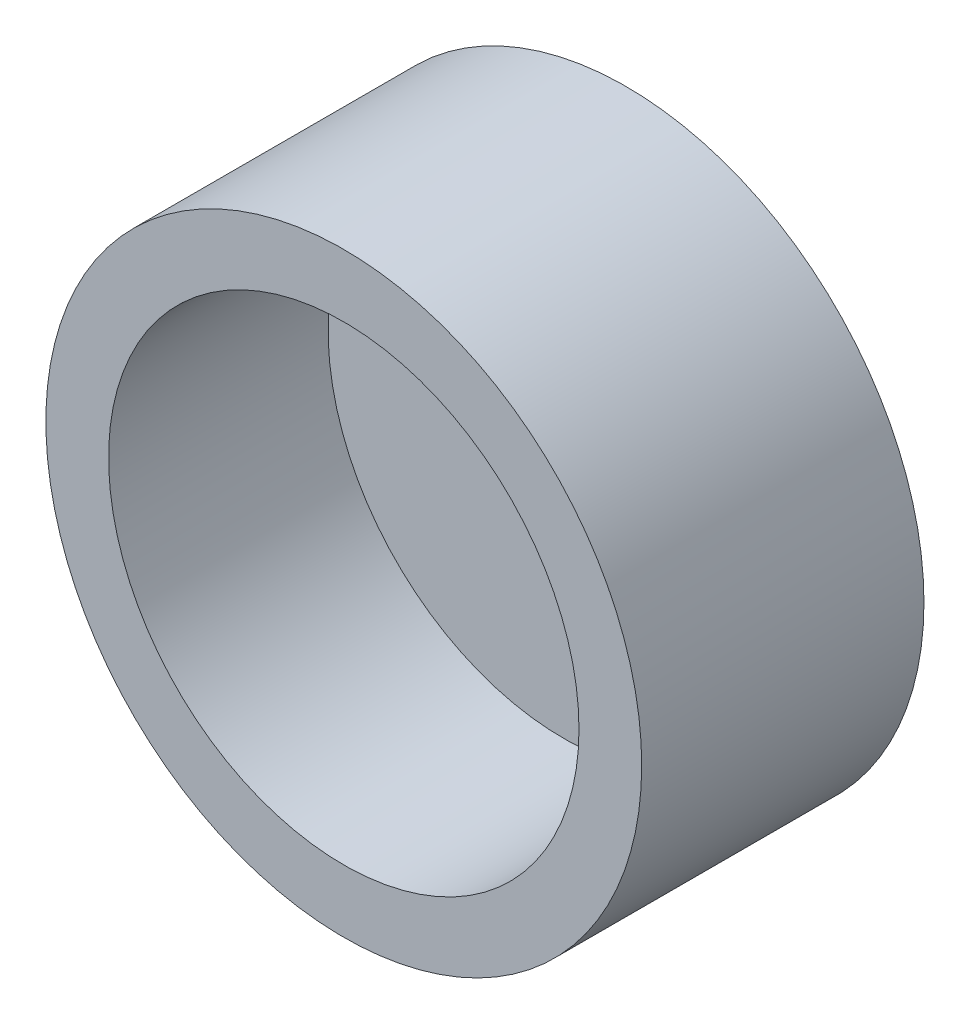
ISO-10303-21;
HEADER;
FILE_DESCRIPTION(('STEP AP214'),'2;1');
FILE_NAME('part.step','',(''),(''),'','','');
FILE_SCHEMA(('AUTOMOTIVE_DESIGN { 1 0 10303 214 1 1 1 1 }'));
ENDSEC;
DATA;
#1=APPLICATION_CONTEXT('core data for automotive mechanical design processes');
#2=APPLICATION_PROTOCOL_DEFINITION('international standard','automotive_design',2000,#1);
#3=PRODUCT_CONTEXT('',#1,'mechanical');
#4=PRODUCT('Part','Part','',(#3));
#5=PRODUCT_RELATED_PRODUCT_CATEGORY('part','',(#4));
#6=PRODUCT_DEFINITION_FORMATION('','',#4);
#7=PRODUCT_DEFINITION_CONTEXT('part definition',#1,'design');
#8=PRODUCT_DEFINITION('design','',#6,#7);
#9=PRODUCT_DEFINITION_SHAPE('','',#8);
#10=(LENGTH_UNIT() NAMED_UNIT(*) SI_UNIT(.MILLI.,.METRE.));
#11=(NAMED_UNIT(*) PLANE_ANGLE_UNIT() SI_UNIT($,.RADIAN.));
#12=(NAMED_UNIT(*) SI_UNIT($,.STERADIAN.) SOLID_ANGLE_UNIT());
#13=UNCERTAINTY_MEASURE_WITH_UNIT(LENGTH_MEASURE(1.E-05),#10,'distance_accuracy_value','');
#14=(GEOMETRIC_REPRESENTATION_CONTEXT(3) GLOBAL_UNCERTAINTY_ASSIGNED_CONTEXT((#13)) GLOBAL_UNIT_ASSIGNED_CONTEXT((#10,
#11,#12)) REPRESENTATION_CONTEXT('',''));
#15=CARTESIAN_POINT('',(0.,0.,0.));
#16=DIRECTION('',(0.,0.,1.));
#17=DIRECTION('',(1.,0.,0.));
#18=AXIS2_PLACEMENT_3D('',#15,#16,#17);
#19=CARTESIAN_POINT('',(0.,0.,9.));
#20=DIRECTION('',(0.,0.,-1.));
#21=DIRECTION('',(-1.,0.,0.));
#22=AXIS2_PLACEMENT_3D('',#19,#20,#21);
#23=CYLINDRICAL_SURFACE('',#22,9.5);
#24=CARTESIAN_POINT('',(0.,0.,9.));
#25=DIRECTION('',(0.,0.,1.));
#26=DIRECTION('',(1.,0.,0.));
#27=AXIS2_PLACEMENT_3D('',#24,#25,#26);
#28=CIRCLE('',#27,9.5);
#29=CARTESIAN_POINT('',(9.5,0.,9.));
#30=VERTEX_POINT('',#29);
#31=EDGE_CURVE('E10',#30,#30,#28,.T.);
#32=ORIENTED_EDGE('',*,*,#31,.F.);
#33=EDGE_LOOP('',(#32));
#34=FACE_BOUND('',#33,.T.);
#35=CARTESIAN_POINT('',(0.,0.,0.));
#36=DIRECTION('',(0.,0.,1.));
#37=DIRECTION('',(1.,0.,0.));
#38=AXIS2_PLACEMENT_3D('',#35,#36,#37);
#39=CIRCLE('',#38,9.5);
#40=CARTESIAN_POINT('',(9.5,0.,0.));
#41=VERTEX_POINT('',#40);
#42=EDGE_CURVE('E35',#41,#41,#39,.T.);
#43=ORIENTED_EDGE('',*,*,#42,.T.);
#44=EDGE_LOOP('',(#43));
#45=FACE_BOUND('',#44,.T.);
#46=ADVANCED_FACE('F32',(#34,#45),#23,.T.);
#47=CARTESIAN_POINT('',(0.,0.,9.));
#48=DIRECTION('',(0.,0.,1.));
#49=DIRECTION('',(1.,0.,0.));
#50=AXIS2_PLACEMENT_3D('',#47,#48,#49);
#51=PLANE('',#50);
#52=CARTESIAN_POINT('',(0.,0.,9.));
#53=DIRECTION('',(0.,0.,1.));
#54=DIRECTION('',(1.,0.,0.));
#55=AXIS2_PLACEMENT_3D('',#52,#53,#54);
#56=CIRCLE('',#55,7.5);
#57=CARTESIAN_POINT('',(7.5,0.,9.));
#58=VERTEX_POINT('',#57);
#59=EDGE_CURVE('E44',#58,#58,#56,.T.);
#60=ORIENTED_EDGE('',*,*,#59,.F.);
#61=EDGE_LOOP('',(#60));
#62=FACE_BOUND('',#61,.T.);
#63=ORIENTED_EDGE('',*,*,#31,.T.);
#64=EDGE_LOOP('',(#63));
#65=FACE_BOUND('',#64,.T.);
#66=ADVANCED_FACE('F59',(#62,#65),#51,.T.);
#67=CARTESIAN_POINT('',(0.,0.,0.));
#68=DIRECTION('',(0.,0.,1.));
#69=DIRECTION('',(1.,0.,0.));
#70=AXIS2_PLACEMENT_3D('',#67,#68,#69);
#71=PLANE('',#70);
#72=ORIENTED_EDGE('',*,*,#42,.F.);
#73=EDGE_LOOP('',(#72));
#74=FACE_BOUND('',#73,.T.);
#75=ADVANCED_FACE('F55',(#74),#71,.F.);
#76=CARTESIAN_POINT('',(0.,0.,2.));
#77=DIRECTION('',(0.,0.,1.));
#78=DIRECTION('',(1.,0.,0.));
#79=AXIS2_PLACEMENT_3D('',#76,#77,#78);
#80=CYLINDRICAL_SURFACE('',#79,7.5);
#81=CARTESIAN_POINT('',(0.,0.,2.));
#82=DIRECTION('',(0.,0.,1.));
#83=DIRECTION('',(1.,0.,0.));
#84=AXIS2_PLACEMENT_3D('',#81,#82,#83);
#85=CIRCLE('',#84,7.5);
#86=CARTESIAN_POINT('',(7.5,0.,2.));
#87=VERTEX_POINT('',#86);
#88=EDGE_CURVE('E42',#87,#87,#85,.T.);
#89=ORIENTED_EDGE('',*,*,#88,.F.);
#90=EDGE_LOOP('',(#89));
#91=FACE_BOUND('',#90,.T.);
#92=ORIENTED_EDGE('',*,*,#59,.T.);
#93=EDGE_LOOP('',(#92));
#94=FACE_BOUND('',#93,.T.);
#95=ADVANCED_FACE('F52',(#91,#94),#80,.F.);
#96=CARTESIAN_POINT('',(0.,0.,2.));
#97=DIRECTION('',(0.,0.,1.));
#98=DIRECTION('',(1.,0.,0.));
#99=AXIS2_PLACEMENT_3D('',#96,#97,#98);
#100=PLANE('',#99);
#101=ORIENTED_EDGE('',*,*,#88,.T.);
#102=EDGE_LOOP('',(#101));
#103=FACE_BOUND('',#102,.T.);
#104=ADVANCED_FACE('F50',(#103),#100,.T.);
#105=CLOSED_SHELL('',(#46,#66,#75,#95,#104));
#106=MANIFOLD_SOLID_BREP('B2',#105);
#107=ADVANCED_BREP_SHAPE_REPRESENTATION('',(#18,#106),#14);
#108=SHAPE_DEFINITION_REPRESENTATION(#9,#107);
ENDSEC;
END-ISO-10303-21;
